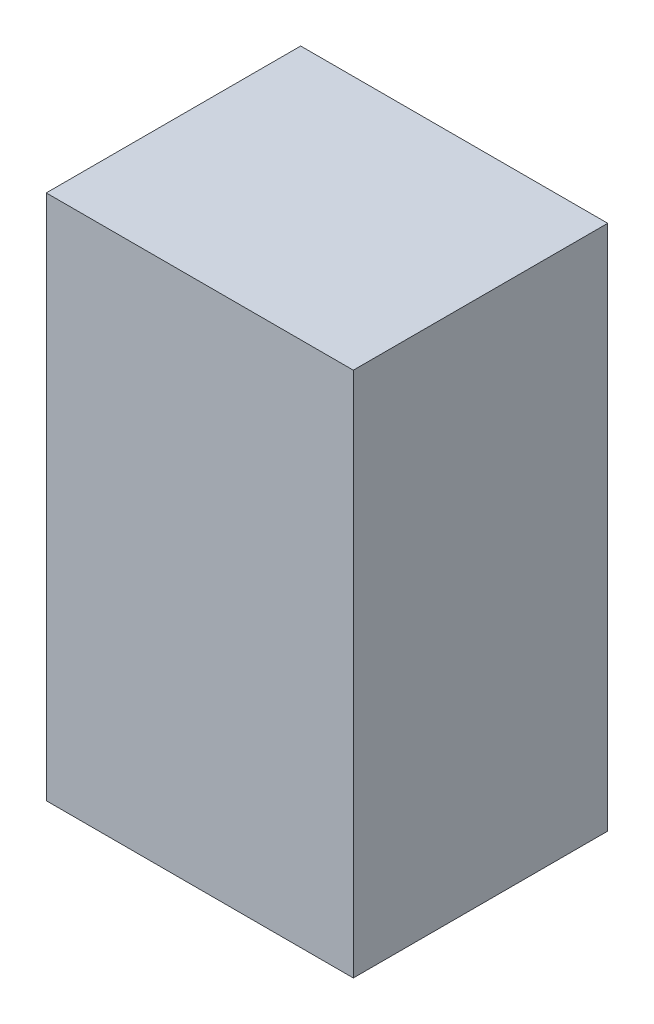
ISO-10303-21;
HEADER;
FILE_DESCRIPTION(('STEP AP214'),'2;1');
FILE_NAME('part.step','',(''),(''),'','','');
FILE_SCHEMA(('AUTOMOTIVE_DESIGN { 1 0 10303 214 1 1 1 1 }'));
ENDSEC;
DATA;
#1=APPLICATION_CONTEXT('core data for automotive mechanical design processes');
#2=APPLICATION_PROTOCOL_DEFINITION('international standard','automotive_design',2000,#1);
#3=PRODUCT_CONTEXT('',#1,'mechanical');
#4=PRODUCT('Part','Part','',(#3));
#5=PRODUCT_RELATED_PRODUCT_CATEGORY('part','',(#4));
#6=PRODUCT_DEFINITION_FORMATION('','',#4);
#7=PRODUCT_DEFINITION_CONTEXT('part definition',#1,'design');
#8=PRODUCT_DEFINITION('design','',#6,#7);
#9=PRODUCT_DEFINITION_SHAPE('','',#8);
#10=(LENGTH_UNIT() NAMED_UNIT(*) SI_UNIT(.MILLI.,.METRE.));
#11=(NAMED_UNIT(*) PLANE_ANGLE_UNIT() SI_UNIT($,.RADIAN.));
#12=(NAMED_UNIT(*) SI_UNIT($,.STERADIAN.) SOLID_ANGLE_UNIT());
#13=UNCERTAINTY_MEASURE_WITH_UNIT(LENGTH_MEASURE(1.E-05),#10,'distance_accuracy_value','');
#14=(GEOMETRIC_REPRESENTATION_CONTEXT(3) GLOBAL_UNCERTAINTY_ASSIGNED_CONTEXT((#13)) GLOBAL_UNIT_ASSIGNED_CONTEXT((#10,
#11,#12)) REPRESENTATION_CONTEXT('',''));
#15=CARTESIAN_POINT('',(0.,0.,0.));
#16=DIRECTION('',(0.,0.,1.));
#17=DIRECTION('',(1.,0.,0.));
#18=AXIS2_PLACEMENT_3D('',#15,#16,#17);
#19=CARTESIAN_POINT('',(-0.87499952,1.49999954,0.));
#20=DIRECTION('',(1.,0.,0.));
#21=DIRECTION('',(0.,-1.,0.));
#22=AXIS2_PLACEMENT_3D('',#19,#20,#21);
#23=PLANE('',#22);
#24=DIRECTION('',(0.,-1.,0.));
#25=VECTOR('',#24,1.);
#26=CARTESIAN_POINT('',(-0.87499952,1.49999954,0.));
#27=LINE('',#26,#25);
#28=CARTESIAN_POINT('',(-0.87499952,1.49999954,0.));
#29=VERTEX_POINT('',#28);
#30=CARTESIAN_POINT('',(-0.87499952,-1.49999954,0.));
#31=VERTEX_POINT('',#30);
#32=EDGE_CURVE('E11',#29,#31,#27,.T.);
#33=ORIENTED_EDGE('',*,*,#32,.T.);
#34=DIRECTION('',(0.,0.,1.));
#35=VECTOR('',#34,1.);
#36=CARTESIAN_POINT('',(-0.87499952,-1.49999954,0.));
#37=LINE('',#36,#35);
#38=CARTESIAN_POINT('',(-0.87499952,-1.49999954,1.44999964));
#39=VERTEX_POINT('',#38);
#40=EDGE_CURVE('E24',#31,#39,#37,.T.);
#41=ORIENTED_EDGE('',*,*,#40,.T.);
#42=DIRECTION('',(0.,-1.,0.));
#43=VECTOR('',#42,1.);
#44=CARTESIAN_POINT('',(-0.87499952,1.49999954,1.44999964));
#45=LINE('',#44,#43);
#46=CARTESIAN_POINT('',(-0.87499952,1.49999954,1.44999964));
#47=VERTEX_POINT('',#46);
#48=EDGE_CURVE('E87',#47,#39,#45,.T.);
#49=ORIENTED_EDGE('',*,*,#48,.F.);
#50=DIRECTION('',(0.,0.,1.));
#51=VECTOR('',#50,1.);
#52=CARTESIAN_POINT('',(-0.87499952,1.49999954,0.));
#53=LINE('',#52,#51);
#54=EDGE_CURVE('E36',#29,#47,#53,.T.);
#55=ORIENTED_EDGE('',*,*,#54,.F.);
#56=EDGE_LOOP('',(#33,#41,#49,#55));
#57=FACE_BOUND('',#56,.T.);
#58=ADVANCED_FACE('F17',(#57),#23,.F.);
#59=CARTESIAN_POINT('',(-0.87499952,-1.49999954,0.));
#60=DIRECTION('',(0.,1.,0.));
#61=DIRECTION('',(1.,0.,0.));
#62=AXIS2_PLACEMENT_3D('',#59,#60,#61);
#63=PLANE('',#62);
#64=DIRECTION('',(1.,0.,0.));
#65=VECTOR('',#64,1.);
#66=CARTESIAN_POINT('',(-0.87499952,-1.49999954,0.));
#67=LINE('',#66,#65);
#68=CARTESIAN_POINT('',(0.87499952,-1.49999954,0.));
#69=VERTEX_POINT('',#68);
#70=EDGE_CURVE('E84',#31,#69,#67,.T.);
#71=ORIENTED_EDGE('',*,*,#70,.T.);
#72=DIRECTION('',(0.,0.,1.));
#73=VECTOR('',#72,1.);
#74=CARTESIAN_POINT('',(0.87499952,-1.49999954,0.));
#75=LINE('',#74,#73);
#76=CARTESIAN_POINT('',(0.87499952,-1.49999954,1.44999964));
#77=VERTEX_POINT('',#76);
#78=EDGE_CURVE('E82',#69,#77,#75,.T.);
#79=ORIENTED_EDGE('',*,*,#78,.T.);
#80=DIRECTION('',(1.,0.,0.));
#81=VECTOR('',#80,1.);
#82=CARTESIAN_POINT('',(-0.87499952,-1.49999954,1.44999964));
#83=LINE('',#82,#81);
#84=EDGE_CURVE('E62',#39,#77,#83,.T.);
#85=ORIENTED_EDGE('',*,*,#84,.F.);
#86=ORIENTED_EDGE('',*,*,#40,.F.);
#87=EDGE_LOOP('',(#71,#79,#85,#86));
#88=FACE_BOUND('',#87,.T.);
#89=ADVANCED_FACE('F89',(#88),#63,.F.);
#90=CARTESIAN_POINT('',(0.87499952,-1.49999954,0.));
#91=DIRECTION('',(-1.,0.,0.));
#92=DIRECTION('',(0.,1.,0.));
#93=AXIS2_PLACEMENT_3D('',#90,#91,#92);
#94=PLANE('',#93);
#95=DIRECTION('',(0.,1.,0.));
#96=VECTOR('',#95,1.);
#97=CARTESIAN_POINT('',(0.87499952,-1.49999954,0.));
#98=LINE('',#97,#96);
#99=CARTESIAN_POINT('',(0.87499952,1.49999954,0.));
#100=VERTEX_POINT('',#99);
#101=EDGE_CURVE('E71',#69,#100,#98,.T.);
#102=ORIENTED_EDGE('',*,*,#101,.T.);
#103=DIRECTION('',(0.,0.,1.));
#104=VECTOR('',#103,1.);
#105=CARTESIAN_POINT('',(0.87499952,1.49999954,0.));
#106=LINE('',#105,#104);
#107=CARTESIAN_POINT('',(0.87499952,1.49999954,1.44999964));
#108=VERTEX_POINT('',#107);
#109=EDGE_CURVE('E65',#100,#108,#106,.T.);
#110=ORIENTED_EDGE('',*,*,#109,.T.);
#111=DIRECTION('',(0.,1.,0.));
#112=VECTOR('',#111,1.);
#113=CARTESIAN_POINT('',(0.87499952,-1.49999954,1.44999964));
#114=LINE('',#113,#112);
#115=EDGE_CURVE('E57',#77,#108,#114,.T.);
#116=ORIENTED_EDGE('',*,*,#115,.F.);
#117=ORIENTED_EDGE('',*,*,#78,.F.);
#118=EDGE_LOOP('',(#102,#110,#116,#117));
#119=FACE_BOUND('',#118,.T.);
#120=ADVANCED_FACE('F69',(#119),#94,.F.);
#121=CARTESIAN_POINT('',(0.87499952,1.49999954,0.));
#122=DIRECTION('',(0.,-1.,0.));
#123=DIRECTION('',(-1.,0.,0.));
#124=AXIS2_PLACEMENT_3D('',#121,#122,#123);
#125=PLANE('',#124);
#126=DIRECTION('',(-1.,0.,0.));
#127=VECTOR('',#126,1.);
#128=CARTESIAN_POINT('',(0.87499952,1.49999954,0.));
#129=LINE('',#128,#127);
#130=EDGE_CURVE('E66',#100,#29,#129,.T.);
#131=ORIENTED_EDGE('',*,*,#130,.T.);
#132=ORIENTED_EDGE('',*,*,#54,.T.);
#133=DIRECTION('',(-1.,0.,0.));
#134=VECTOR('',#133,1.);
#135=CARTESIAN_POINT('',(0.87499952,1.49999954,1.44999964));
#136=LINE('',#135,#134);
#137=EDGE_CURVE('E61',#108,#47,#136,.T.);
#138=ORIENTED_EDGE('',*,*,#137,.F.);
#139=ORIENTED_EDGE('',*,*,#109,.F.);
#140=EDGE_LOOP('',(#131,#132,#138,#139));
#141=FACE_BOUND('',#140,.T.);
#142=ADVANCED_FACE('F76',(#141),#125,.F.);
#143=CARTESIAN_POINT('',(-0.87499952,1.49999954,0.));
#144=DIRECTION('',(0.,0.,-1.));
#145=DIRECTION('',(-1.,0.,0.));
#146=AXIS2_PLACEMENT_3D('',#143,#144,#145);
#147=PLANE('',#146);
#148=ORIENTED_EDGE('',*,*,#130,.F.);
#149=ORIENTED_EDGE('',*,*,#101,.F.);
#150=ORIENTED_EDGE('',*,*,#70,.F.);
#151=ORIENTED_EDGE('',*,*,#32,.F.);
#152=EDGE_LOOP('',(#148,#149,#150,#151));
#153=FACE_BOUND('',#152,.T.);
#154=ADVANCED_FACE('F91',(#153),#147,.T.);
#155=CARTESIAN_POINT('',(-0.87499952,1.49999954,1.44999964));
#156=DIRECTION('',(0.,0.,-1.));
#157=DIRECTION('',(-1.,0.,0.));
#158=AXIS2_PLACEMENT_3D('',#155,#156,#157);
#159=PLANE('',#158);
#160=ORIENTED_EDGE('',*,*,#48,.T.);
#161=ORIENTED_EDGE('',*,*,#84,.T.);
#162=ORIENTED_EDGE('',*,*,#115,.T.);
#163=ORIENTED_EDGE('',*,*,#137,.T.);
#164=EDGE_LOOP('',(#160,#161,#162,#163));
#165=FACE_BOUND('',#164,.T.);
#166=ADVANCED_FACE('F59',(#165),#159,.F.);
#167=CLOSED_SHELL('',(#58,#89,#120,#142,#154,#166));
#168=MANIFOLD_SOLID_BREP('B1',#167);
#169=ADVANCED_BREP_SHAPE_REPRESENTATION('',(#18,#168),#14);
#170=SHAPE_DEFINITION_REPRESENTATION(#9,#169);
ENDSEC;
END-ISO-10303-21;
